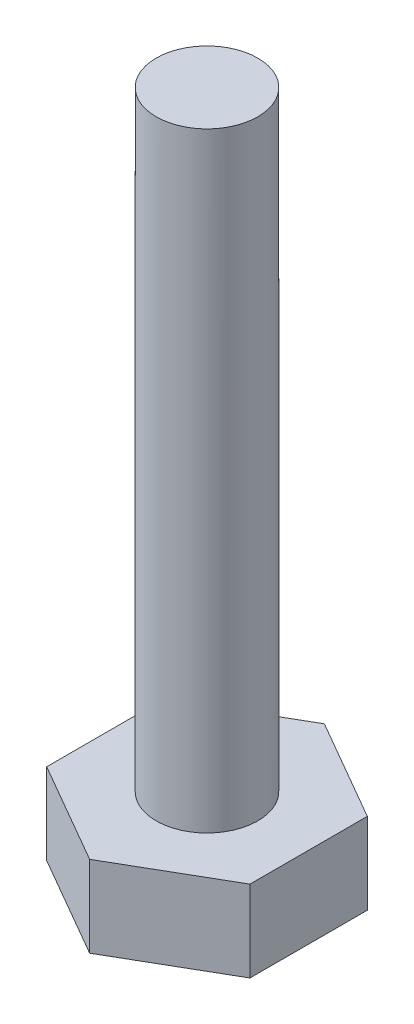
ISO-10303-21;
HEADER;
FILE_DESCRIPTION(('STEP AP214'),'2;1');
FILE_NAME('part.step','',(''),(''),'','','');
FILE_SCHEMA(('AUTOMOTIVE_DESIGN { 1 0 10303 214 1 1 1 1 }'));
ENDSEC;
DATA;
#1=APPLICATION_CONTEXT('core data for automotive mechanical design processes');
#2=APPLICATION_PROTOCOL_DEFINITION('international standard','automotive_design',2000,#1);
#3=PRODUCT_CONTEXT('',#1,'mechanical');
#4=PRODUCT('Part','Part','',(#3));
#5=PRODUCT_RELATED_PRODUCT_CATEGORY('part','',(#4));
#6=PRODUCT_DEFINITION_FORMATION('','',#4);
#7=PRODUCT_DEFINITION_CONTEXT('part definition',#1,'design');
#8=PRODUCT_DEFINITION('design','',#6,#7);
#9=PRODUCT_DEFINITION_SHAPE('','',#8);
#10=(LENGTH_UNIT() NAMED_UNIT(*) SI_UNIT(.MILLI.,.METRE.));
#11=(NAMED_UNIT(*) PLANE_ANGLE_UNIT() SI_UNIT($,.RADIAN.));
#12=(NAMED_UNIT(*) SI_UNIT($,.STERADIAN.) SOLID_ANGLE_UNIT());
#13=UNCERTAINTY_MEASURE_WITH_UNIT(LENGTH_MEASURE(1.E-05),#10,'distance_accuracy_value','');
#14=(GEOMETRIC_REPRESENTATION_CONTEXT(3) GLOBAL_UNCERTAINTY_ASSIGNED_CONTEXT((#13)) GLOBAL_UNIT_ASSIGNED_CONTEXT((#10,
#11,#12)) REPRESENTATION_CONTEXT('',''));
#15=CARTESIAN_POINT('',(0.,0.,0.));
#16=DIRECTION('',(0.,0.,1.));
#17=DIRECTION('',(1.,0.,0.));
#18=AXIS2_PLACEMENT_3D('',#15,#16,#17);
#19=CARTESIAN_POINT('',(0.,30.,0.));
#20=DIRECTION('',(0.,-1.,0.));
#21=DIRECTION('',(0.,0.,-1.));
#22=AXIS2_PLACEMENT_3D('',#19,#20,#21);
#23=CYLINDRICAL_SURFACE('',#22,2.5);
#24=CARTESIAN_POINT('',(0.,30.,0.));
#25=DIRECTION('',(0.,1.,0.));
#26=DIRECTION('',(0.,0.,1.));
#27=AXIS2_PLACEMENT_3D('',#24,#25,#26);
#28=CIRCLE('',#27,2.5);
#29=CARTESIAN_POINT('',(0.,30.,2.5));
#30=VERTEX_POINT('',#29);
#31=EDGE_CURVE('E11',#30,#30,#28,.T.);
#32=ORIENTED_EDGE('',*,*,#31,.F.);
#33=EDGE_LOOP('',(#32));
#34=FACE_BOUND('',#33,.T.);
#35=CARTESIAN_POINT('',(0.,0.,0.));
#36=DIRECTION('',(0.,-1.,0.));
#37=DIRECTION('',(0.,0.,-1.));
#38=AXIS2_PLACEMENT_3D('',#35,#36,#37);
#39=CIRCLE('',#38,2.5);
#40=CARTESIAN_POINT('',(0.,0.,-2.5));
#41=VERTEX_POINT('',#40);
#42=EDGE_CURVE('E41',#41,#41,#39,.T.);
#43=ORIENTED_EDGE('',*,*,#42,.F.);
#44=EDGE_LOOP('',(#43));
#45=FACE_BOUND('',#44,.T.);
#46=ADVANCED_FACE('F33',(#34,#45),#23,.T.);
#47=CARTESIAN_POINT('',(0.,30.,0.));
#48=DIRECTION('',(0.,1.,0.));
#49=DIRECTION('',(0.,0.,1.));
#50=AXIS2_PLACEMENT_3D('',#47,#48,#49);
#51=PLANE('',#50);
#52=ORIENTED_EDGE('',*,*,#31,.T.);
#53=EDGE_LOOP('',(#52));
#54=FACE_BOUND('',#53,.T.);
#55=ADVANCED_FACE('F142',(#54),#51,.T.);
#56=CARTESIAN_POINT('',(0.,0.,0.));
#57=DIRECTION('',(0.,-1.,0.));
#58=DIRECTION('',(0.,0.,-1.));
#59=AXIS2_PLACEMENT_3D('',#56,#57,#58);
#60=PLANE('',#59);
#61=DIRECTION('',(-0.866025403784439,0.,0.5));
#62=VECTOR('',#61,1.);
#63=CARTESIAN_POINT('',(4.99999999999999,0.,2.88675134594813));
#64=LINE('',#63,#62);
#65=CARTESIAN_POINT('',(4.99999999999999,0.,2.88675134594813));
#66=VERTEX_POINT('',#65);
#67=CARTESIAN_POINT('',(0.,0.,5.77350269189626));
#68=VERTEX_POINT('',#67);
#69=EDGE_CURVE('E118',#66,#68,#64,.T.);
#70=ORIENTED_EDGE('',*,*,#69,.F.);
#71=DIRECTION('',(0.,0.,1.));
#72=VECTOR('',#71,1.);
#73=CARTESIAN_POINT('',(5.,0.,-2.88675134594813));
#74=LINE('',#73,#72);
#75=CARTESIAN_POINT('',(5.,0.,-2.88675134594813));
#76=VERTEX_POINT('',#75);
#77=EDGE_CURVE('E78',#76,#66,#74,.T.);
#78=ORIENTED_EDGE('',*,*,#77,.F.);
#79=DIRECTION('',(0.866025403784439,0.,0.5));
#80=VECTOR('',#79,1.);
#81=CARTESIAN_POINT('',(0.,0.,-5.77350269189626));
#82=LINE('',#81,#80);
#83=CARTESIAN_POINT('',(0.,0.,-5.77350269189626));
#84=VERTEX_POINT('',#83);
#85=EDGE_CURVE('E72',#84,#76,#82,.T.);
#86=ORIENTED_EDGE('',*,*,#85,.F.);
#87=DIRECTION('',(0.866025403784439,0.,-0.5));
#88=VECTOR('',#87,1.);
#89=CARTESIAN_POINT('',(-5.,0.,-2.88675134594813));
#90=LINE('',#89,#88);
#91=CARTESIAN_POINT('',(-5.,0.,-2.88675134594813));
#92=VERTEX_POINT('',#91);
#93=EDGE_CURVE('E108',#92,#84,#90,.T.);
#94=ORIENTED_EDGE('',*,*,#93,.F.);
#95=DIRECTION('',(0.,0.,-1.));
#96=VECTOR('',#95,1.);
#97=CARTESIAN_POINT('',(-5.,0.,2.88675134594813));
#98=LINE('',#97,#96);
#99=CARTESIAN_POINT('',(-5.,0.,2.88675134594813));
#100=VERTEX_POINT('',#99);
#101=EDGE_CURVE('E123',#100,#92,#98,.T.);
#102=ORIENTED_EDGE('',*,*,#101,.F.);
#103=DIRECTION('',(-0.866025403784439,0.,-0.5));
#104=VECTOR('',#103,1.);
#105=CARTESIAN_POINT('',(0.,0.,5.77350269189626));
#106=LINE('',#105,#104);
#107=EDGE_CURVE('E121',#68,#100,#106,.T.);
#108=ORIENTED_EDGE('',*,*,#107,.F.);
#109=EDGE_LOOP('',(#70,#78,#86,#94,#102,#108));
#110=FACE_BOUND('',#109,.T.);
#111=ORIENTED_EDGE('',*,*,#42,.T.);
#112=EDGE_LOOP('',(#111));
#113=FACE_BOUND('',#112,.T.);
#114=ADVANCED_FACE('F139',(#110,#113),#60,.F.);
#115=CARTESIAN_POINT('',(4.99999999999999,-4.,2.88675134594813));
#116=DIRECTION('',(-0.5,0.,-0.866025403784439));
#117=DIRECTION('',(-0.866025403784439,0.,0.5));
#118=AXIS2_PLACEMENT_3D('',#115,#116,#117);
#119=PLANE('',#118);
#120=ORIENTED_EDGE('',*,*,#69,.T.);
#121=DIRECTION('',(0.,1.,0.));
#122=VECTOR('',#121,1.);
#123=CARTESIAN_POINT('',(0.,-4.,5.77350269189626));
#124=LINE('',#123,#122);
#125=CARTESIAN_POINT('',(0.,-4.,5.77350269189626));
#126=VERTEX_POINT('',#125);
#127=EDGE_CURVE('E135',#126,#68,#124,.T.);
#128=ORIENTED_EDGE('',*,*,#127,.F.);
#129=DIRECTION('',(-0.866025403784439,0.,0.5));
#130=VECTOR('',#129,1.);
#131=CARTESIAN_POINT('',(4.99999999999999,-4.,2.88675134594813));
#132=LINE('',#131,#130);
#133=CARTESIAN_POINT('',(4.99999999999999,-4.,2.88675134594813));
#134=VERTEX_POINT('',#133);
#135=EDGE_CURVE('E128',#134,#126,#132,.T.);
#136=ORIENTED_EDGE('',*,*,#135,.F.);
#137=DIRECTION('',(0.,1.,0.));
#138=VECTOR('',#137,1.);
#139=CARTESIAN_POINT('',(4.99999999999999,-4.,2.88675134594813));
#140=LINE('',#139,#138);
#141=EDGE_CURVE('E114',#134,#66,#140,.T.);
#142=ORIENTED_EDGE('',*,*,#141,.T.);
#143=EDGE_LOOP('',(#120,#128,#136,#142));
#144=FACE_BOUND('',#143,.T.);
#145=ADVANCED_FACE('F152',(#144),#119,.F.);
#146=CARTESIAN_POINT('',(0.,-4.,5.77350269189626));
#147=DIRECTION('',(0.5,0.,-0.866025403784439));
#148=DIRECTION('',(-0.866025403784439,0.,-0.5));
#149=AXIS2_PLACEMENT_3D('',#146,#147,#148);
#150=PLANE('',#149);
#151=ORIENTED_EDGE('',*,*,#107,.T.);
#152=DIRECTION('',(0.,1.,0.));
#153=VECTOR('',#152,1.);
#154=CARTESIAN_POINT('',(-5.,-4.,2.88675134594813));
#155=LINE('',#154,#153);
#156=CARTESIAN_POINT('',(-5.,-4.,2.88675134594813));
#157=VERTEX_POINT('',#156);
#158=EDGE_CURVE('E132',#157,#100,#155,.T.);
#159=ORIENTED_EDGE('',*,*,#158,.F.);
#160=DIRECTION('',(-0.866025403784439,0.,-0.5));
#161=VECTOR('',#160,1.);
#162=CARTESIAN_POINT('',(0.,-4.,5.77350269189626));
#163=LINE('',#162,#161);
#164=EDGE_CURVE('E87',#126,#157,#163,.T.);
#165=ORIENTED_EDGE('',*,*,#164,.F.);
#166=ORIENTED_EDGE('',*,*,#127,.T.);
#167=EDGE_LOOP('',(#151,#159,#165,#166));
#168=FACE_BOUND('',#167,.T.);
#169=ADVANCED_FACE('F158',(#168),#150,.F.);
#170=CARTESIAN_POINT('',(-5.,-4.,2.88675134594813));
#171=DIRECTION('',(1.,0.,0.));
#172=DIRECTION('',(0.,0.,-1.));
#173=AXIS2_PLACEMENT_3D('',#170,#171,#172);
#174=PLANE('',#173);
#175=ORIENTED_EDGE('',*,*,#101,.T.);
#176=DIRECTION('',(0.,1.,0.));
#177=VECTOR('',#176,1.);
#178=CARTESIAN_POINT('',(-5.,-4.,-2.88675134594813));
#179=LINE('',#178,#177);
#180=CARTESIAN_POINT('',(-5.,-4.,-2.88675134594813));
#181=VERTEX_POINT('',#180);
#182=EDGE_CURVE('E109',#181,#92,#179,.T.);
#183=ORIENTED_EDGE('',*,*,#182,.F.);
#184=DIRECTION('',(0.,0.,-1.));
#185=VECTOR('',#184,1.);
#186=CARTESIAN_POINT('',(-5.,-4.,2.88675134594813));
#187=LINE('',#186,#185);
#188=EDGE_CURVE('E100',#157,#181,#187,.T.);
#189=ORIENTED_EDGE('',*,*,#188,.F.);
#190=ORIENTED_EDGE('',*,*,#158,.T.);
#191=EDGE_LOOP('',(#175,#183,#189,#190));
#192=FACE_BOUND('',#191,.T.);
#193=ADVANCED_FACE('F162',(#192),#174,.F.);
#194=CARTESIAN_POINT('',(-5.,-4.,-2.88675134594813));
#195=DIRECTION('',(0.5,0.,0.866025403784439));
#196=DIRECTION('',(0.866025403784439,0.,-0.5));
#197=AXIS2_PLACEMENT_3D('',#194,#195,#196);
#198=PLANE('',#197);
#199=ORIENTED_EDGE('',*,*,#93,.T.);
#200=DIRECTION('',(0.,1.,0.));
#201=VECTOR('',#200,1.);
#202=CARTESIAN_POINT('',(0.,-4.,-5.77350269189626));
#203=LINE('',#202,#201);
#204=CARTESIAN_POINT('',(0.,-4.,-5.77350269189626));
#205=VERTEX_POINT('',#204);
#206=EDGE_CURVE('E105',#205,#84,#203,.T.);
#207=ORIENTED_EDGE('',*,*,#206,.F.);
#208=DIRECTION('',(0.866025403784439,0.,-0.5));
#209=VECTOR('',#208,1.);
#210=CARTESIAN_POINT('',(-5.,-4.,-2.88675134594813));
#211=LINE('',#210,#209);
#212=EDGE_CURVE('E94',#181,#205,#211,.T.);
#213=ORIENTED_EDGE('',*,*,#212,.F.);
#214=ORIENTED_EDGE('',*,*,#182,.T.);
#215=EDGE_LOOP('',(#199,#207,#213,#214));
#216=FACE_BOUND('',#215,.T.);
#217=ADVANCED_FACE('F106',(#216),#198,.F.);
#218=CARTESIAN_POINT('',(0.,-4.,-5.77350269189626));
#219=DIRECTION('',(-0.5,0.,0.866025403784439));
#220=DIRECTION('',(0.866025403784439,0.,0.5));
#221=AXIS2_PLACEMENT_3D('',#218,#219,#220);
#222=PLANE('',#221);
#223=ORIENTED_EDGE('',*,*,#85,.T.);
#224=DIRECTION('',(0.,1.,0.));
#225=VECTOR('',#224,1.);
#226=CARTESIAN_POINT('',(5.,-4.,-2.88675134594813));
#227=LINE('',#226,#225);
#228=CARTESIAN_POINT('',(5.,-4.,-2.88675134594813));
#229=VERTEX_POINT('',#228);
#230=EDGE_CURVE('E110',#229,#76,#227,.T.);
#231=ORIENTED_EDGE('',*,*,#230,.F.);
#232=DIRECTION('',(0.866025403784439,0.,0.5));
#233=VECTOR('',#232,1.);
#234=CARTESIAN_POINT('',(0.,-4.,-5.77350269189626));
#235=LINE('',#234,#233);
#236=EDGE_CURVE('E98',#205,#229,#235,.T.);
#237=ORIENTED_EDGE('',*,*,#236,.F.);
#238=ORIENTED_EDGE('',*,*,#206,.T.);
#239=EDGE_LOOP('',(#223,#231,#237,#238));
#240=FACE_BOUND('',#239,.T.);
#241=ADVANCED_FACE('F112',(#240),#222,.F.);
#242=CARTESIAN_POINT('',(5.,-4.,-2.88675134594813));
#243=DIRECTION('',(-1.,0.,0.));
#244=DIRECTION('',(0.,0.,1.));
#245=AXIS2_PLACEMENT_3D('',#242,#243,#244);
#246=PLANE('',#245);
#247=ORIENTED_EDGE('',*,*,#77,.T.);
#248=ORIENTED_EDGE('',*,*,#141,.F.);
#249=DIRECTION('',(0.,0.,1.));
#250=VECTOR('',#249,1.);
#251=CARTESIAN_POINT('',(5.,-4.,-2.88675134594813));
#252=LINE('',#251,#250);
#253=EDGE_CURVE('E49',#229,#134,#252,.T.);
#254=ORIENTED_EDGE('',*,*,#253,.F.);
#255=ORIENTED_EDGE('',*,*,#230,.T.);
#256=EDGE_LOOP('',(#247,#248,#254,#255));
#257=FACE_BOUND('',#256,.T.);
#258=ADVANCED_FACE('F170',(#257),#246,.F.);
#259=CARTESIAN_POINT('',(0.,-4.,0.));
#260=DIRECTION('',(0.,-1.,0.));
#261=DIRECTION('',(0.,0.,-1.));
#262=AXIS2_PLACEMENT_3D('',#259,#260,#261);
#263=PLANE('',#262);
#264=ORIENTED_EDGE('',*,*,#135,.T.);
#265=ORIENTED_EDGE('',*,*,#164,.T.);
#266=ORIENTED_EDGE('',*,*,#188,.T.);
#267=ORIENTED_EDGE('',*,*,#212,.T.);
#268=ORIENTED_EDGE('',*,*,#236,.T.);
#269=ORIENTED_EDGE('',*,*,#253,.T.);
#270=EDGE_LOOP('',(#264,#265,#266,#267,#268,#269));
#271=FACE_BOUND('',#270,.T.);
#272=ADVANCED_FACE('F96',(#271),#263,.T.);
#273=CLOSED_SHELL('',(#46,#55,#114,#145,#169,#193,#217,#241,#258,#272));
#274=MANIFOLD_SOLID_BREP('B2',#273);
#275=ADVANCED_BREP_SHAPE_REPRESENTATION('',(#18,#274),#14);
#276=SHAPE_DEFINITION_REPRESENTATION(#9,#275);
ENDSEC;
END-ISO-10303-21;
